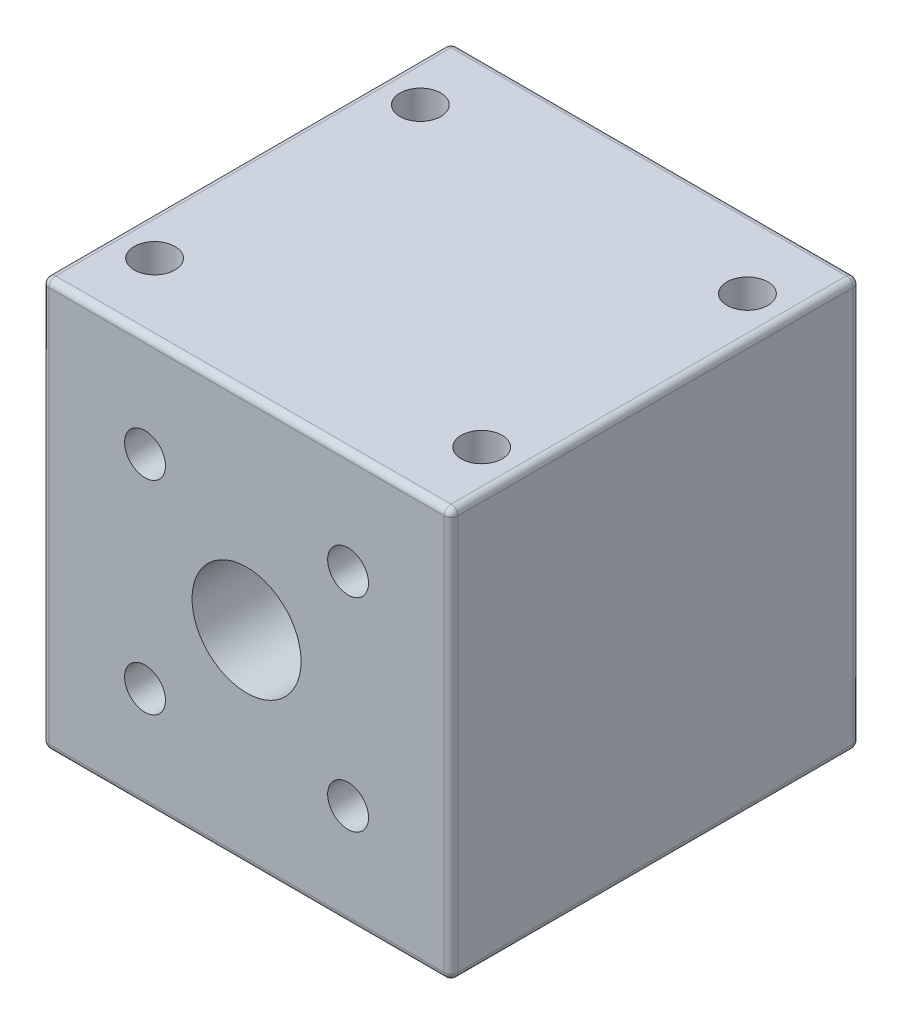
ISO-10303-21;
HEADER;
FILE_DESCRIPTION(('STEP AP214'),'2;1');
FILE_NAME('part.step','',(''),(''),'','','');
FILE_SCHEMA(('AUTOMOTIVE_DESIGN { 1 0 10303 214 1 1 1 1 }'));
ENDSEC;
DATA;
#1=APPLICATION_CONTEXT('core data for automotive mechanical design processes');
#2=APPLICATION_PROTOCOL_DEFINITION('international standard','automotive_design',2000,#1);
#3=PRODUCT_CONTEXT('',#1,'mechanical');
#4=PRODUCT('Part','Part','',(#3));
#5=PRODUCT_RELATED_PRODUCT_CATEGORY('part','',(#4));
#6=PRODUCT_DEFINITION_FORMATION('','',#4);
#7=PRODUCT_DEFINITION_CONTEXT('part definition',#1,'design');
#8=PRODUCT_DEFINITION('design','',#6,#7);
#9=PRODUCT_DEFINITION_SHAPE('','',#8);
#10=(LENGTH_UNIT() NAMED_UNIT(*) SI_UNIT(.MILLI.,.METRE.));
#11=(NAMED_UNIT(*) PLANE_ANGLE_UNIT() SI_UNIT($,.RADIAN.));
#12=(NAMED_UNIT(*) SI_UNIT($,.STERADIAN.) SOLID_ANGLE_UNIT());
#13=UNCERTAINTY_MEASURE_WITH_UNIT(LENGTH_MEASURE(1.E-05),#10,'distance_accuracy_value','');
#14=(GEOMETRIC_REPRESENTATION_CONTEXT(3) GLOBAL_UNCERTAINTY_ASSIGNED_CONTEXT((#13)) GLOBAL_UNIT_ASSIGNED_CONTEXT((#10,
#11,#12)) REPRESENTATION_CONTEXT('',''));
#15=CARTESIAN_POINT('',(0.,0.,0.));
#16=DIRECTION('',(0.,0.,1.));
#17=DIRECTION('',(1.,0.,0.));
#18=AXIS2_PLACEMENT_3D('',#15,#16,#17);
#19=CARTESIAN_POINT('',(14.5,-14.5,0.5));
#20=DIRECTION('',(0.,1.,0.));
#21=DIRECTION('',(0.,0.,1.));
#22=AXIS2_PLACEMENT_3D('',#19,#20,#21);
#23=CYLINDRICAL_SURFACE('',#22,0.5);
#24=CARTESIAN_POINT('',(14.5,-14.5,0.5));
#25=DIRECTION('',(0.,-1.,0.));
#26=DIRECTION('',(0.,0.,-1.));
#27=AXIS2_PLACEMENT_3D('',#24,#25,#26);
#28=CIRCLE('',#27,0.5);
#29=CARTESIAN_POINT('',(14.5,-14.5,0.));
#30=VERTEX_POINT('',#29);
#31=CARTESIAN_POINT('',(15.,-14.5,0.5));
#32=VERTEX_POINT('',#31);
#33=EDGE_CURVE('E11',#30,#32,#28,.T.);
#34=ORIENTED_EDGE('',*,*,#33,.F.);
#35=DIRECTION('',(0.,-1.,0.));
#36=VECTOR('',#35,1.);
#37=CARTESIAN_POINT('',(14.5,-14.5,0.));
#38=LINE('',#37,#36);
#39=CARTESIAN_POINT('',(14.5,14.5,0.));
#40=VERTEX_POINT('',#39);
#41=EDGE_CURVE('E203',#40,#30,#38,.T.);
#42=ORIENTED_EDGE('',*,*,#41,.F.);
#43=CARTESIAN_POINT('',(14.5,14.5,0.5));
#44=DIRECTION('',(0.,-1.,0.));
#45=DIRECTION('',(0.,0.,-1.));
#46=AXIS2_PLACEMENT_3D('',#43,#44,#45);
#47=CIRCLE('',#46,0.5);
#48=CARTESIAN_POINT('',(15.,14.5,0.5));
#49=VERTEX_POINT('',#48);
#50=EDGE_CURVE('E44',#40,#49,#47,.T.);
#51=ORIENTED_EDGE('',*,*,#50,.T.);
#52=DIRECTION('',(0.,-1.,0.));
#53=VECTOR('',#52,1.);
#54=CARTESIAN_POINT('',(15.,-14.5,0.5));
#55=LINE('',#54,#53);
#56=EDGE_CURVE('E232',#32,#49,#55,.F.);
#57=ORIENTED_EDGE('',*,*,#56,.F.);
#58=EDGE_LOOP('',(#34,#42,#51,#57));
#59=FACE_BOUND('',#58,.T.);
#60=ADVANCED_FACE('F37',(#59),#23,.T.);
#61=CARTESIAN_POINT('',(14.5,14.5,0.5));
#62=DIRECTION('',(0.,0.,-1.));
#63=DIRECTION('',(-1.,0.,0.));
#64=AXIS2_PLACEMENT_3D('',#61,#62,#63);
#65=SPHERICAL_SURFACE('',#64,0.5);
#66=ORIENTED_EDGE('',*,*,#50,.F.);
#67=CARTESIAN_POINT('',(14.5,14.5,0.5));
#68=DIRECTION('',(1.,0.,0.));
#69=DIRECTION('',(0.,0.,-1.));
#70=AXIS2_PLACEMENT_3D('',#67,#68,#69);
#71=CIRCLE('',#70,0.5);
#72=CARTESIAN_POINT('',(14.5,15.,0.5));
#73=VERTEX_POINT('',#72);
#74=EDGE_CURVE('E57',#40,#73,#71,.T.);
#75=ORIENTED_EDGE('',*,*,#74,.T.);
#76=CARTESIAN_POINT('',(14.5,14.5,0.5));
#77=DIRECTION('',(0.,0.,-1.));
#78=DIRECTION('',(-1.,0.,0.));
#79=AXIS2_PLACEMENT_3D('',#76,#77,#78);
#80=CIRCLE('',#79,0.5);
#81=EDGE_CURVE('E230',#49,#73,#80,.F.);
#82=ORIENTED_EDGE('',*,*,#81,.F.);
#83=EDGE_LOOP('',(#66,#75,#82));
#84=FACE_BOUND('',#83,.T.);
#85=ADVANCED_FACE('F297',(#84),#65,.T.);
#86=CARTESIAN_POINT('',(-14.5,14.5,0.5));
#87=DIRECTION('',(-1.,0.,0.));
#88=DIRECTION('',(0.,0.,1.));
#89=AXIS2_PLACEMENT_3D('',#86,#87,#88);
#90=CYLINDRICAL_SURFACE('',#89,0.5);
#91=ORIENTED_EDGE('',*,*,#74,.F.);
#92=DIRECTION('',(1.,0.,0.));
#93=VECTOR('',#92,1.);
#94=CARTESIAN_POINT('',(-14.5,14.5,0.));
#95=LINE('',#94,#93);
#96=CARTESIAN_POINT('',(-14.5,14.5,0.));
#97=VERTEX_POINT('',#96);
#98=EDGE_CURVE('E206',#97,#40,#95,.T.);
#99=ORIENTED_EDGE('',*,*,#98,.F.);
#100=CARTESIAN_POINT('',(-14.5,14.5,0.5));
#101=DIRECTION('',(1.,0.,0.));
#102=DIRECTION('',(0.,0.,-1.));
#103=AXIS2_PLACEMENT_3D('',#100,#101,#102);
#104=CIRCLE('',#103,0.5);
#105=CARTESIAN_POINT('',(-14.5,15.,0.5));
#106=VERTEX_POINT('',#105);
#107=EDGE_CURVE('E242',#97,#106,#104,.T.);
#108=ORIENTED_EDGE('',*,*,#107,.T.);
#109=DIRECTION('',(1.,0.,0.));
#110=VECTOR('',#109,1.);
#111=CARTESIAN_POINT('',(-14.5,15.,0.5));
#112=LINE('',#111,#110);
#113=EDGE_CURVE('E227',#73,#106,#112,.F.);
#114=ORIENTED_EDGE('',*,*,#113,.F.);
#115=EDGE_LOOP('',(#91,#99,#108,#114));
#116=FACE_BOUND('',#115,.T.);
#117=ADVANCED_FACE('F247',(#116),#90,.T.);
#118=CARTESIAN_POINT('',(-14.5,14.5,0.5));
#119=DIRECTION('',(0.,0.,-1.));
#120=DIRECTION('',(-1.,0.,0.));
#121=AXIS2_PLACEMENT_3D('',#118,#119,#120);
#122=SPHERICAL_SURFACE('',#121,0.5);
#123=ORIENTED_EDGE('',*,*,#107,.F.);
#124=CARTESIAN_POINT('',(-14.5,14.5,0.5));
#125=DIRECTION('',(0.,1.,0.));
#126=DIRECTION('',(0.,0.,1.));
#127=AXIS2_PLACEMENT_3D('',#124,#125,#126);
#128=CIRCLE('',#127,0.5);
#129=CARTESIAN_POINT('',(-15.,14.5,0.5));
#130=VERTEX_POINT('',#129);
#131=EDGE_CURVE('E240',#97,#130,#128,.T.);
#132=ORIENTED_EDGE('',*,*,#131,.T.);
#133=CARTESIAN_POINT('',(-14.5,14.5,0.5));
#134=DIRECTION('',(0.,0.,-1.));
#135=DIRECTION('',(-1.,0.,0.));
#136=AXIS2_PLACEMENT_3D('',#133,#134,#135);
#137=CIRCLE('',#136,0.5);
#138=EDGE_CURVE('E224',#106,#130,#137,.F.);
#139=ORIENTED_EDGE('',*,*,#138,.F.);
#140=EDGE_LOOP('',(#123,#132,#139));
#141=FACE_BOUND('',#140,.T.);
#142=ADVANCED_FACE('F259',(#141),#122,.T.);
#143=CARTESIAN_POINT('',(-14.5,-14.5,0.5));
#144=DIRECTION('',(0.,-1.,0.));
#145=DIRECTION('',(0.,0.,-1.));
#146=AXIS2_PLACEMENT_3D('',#143,#144,#145);
#147=CYLINDRICAL_SURFACE('',#146,0.5);
#148=ORIENTED_EDGE('',*,*,#131,.F.);
#149=DIRECTION('',(0.,1.,0.));
#150=VECTOR('',#149,1.);
#151=CARTESIAN_POINT('',(-14.5,-14.5,0.));
#152=LINE('',#151,#150);
#153=CARTESIAN_POINT('',(-14.5,-14.5,0.));
#154=VERTEX_POINT('',#153);
#155=EDGE_CURVE('E209',#154,#97,#152,.T.);
#156=ORIENTED_EDGE('',*,*,#155,.F.);
#157=CARTESIAN_POINT('',(-14.5,-14.5,0.5));
#158=DIRECTION('',(0.,1.,0.));
#159=DIRECTION('',(0.,0.,1.));
#160=AXIS2_PLACEMENT_3D('',#157,#158,#159);
#161=CIRCLE('',#160,0.5);
#162=CARTESIAN_POINT('',(-15.,-14.5,0.5));
#163=VERTEX_POINT('',#162);
#164=EDGE_CURVE('E238',#154,#163,#161,.T.);
#165=ORIENTED_EDGE('',*,*,#164,.T.);
#166=DIRECTION('',(0.,1.,0.));
#167=VECTOR('',#166,1.);
#168=CARTESIAN_POINT('',(-15.,-14.5,0.5));
#169=LINE('',#168,#167);
#170=EDGE_CURVE('E221',#130,#163,#169,.F.);
#171=ORIENTED_EDGE('',*,*,#170,.F.);
#172=EDGE_LOOP('',(#148,#156,#165,#171));
#173=FACE_BOUND('',#172,.T.);
#174=ADVANCED_FACE('F325',(#173),#147,.T.);
#175=CARTESIAN_POINT('',(-14.5,-14.5,0.5));
#176=DIRECTION('',(0.,0.,-1.));
#177=DIRECTION('',(-1.,0.,0.));
#178=AXIS2_PLACEMENT_3D('',#175,#176,#177);
#179=SPHERICAL_SURFACE('',#178,0.5);
#180=ORIENTED_EDGE('',*,*,#164,.F.);
#181=CARTESIAN_POINT('',(-14.5,-14.5,0.5));
#182=DIRECTION('',(-1.,0.,0.));
#183=DIRECTION('',(0.,0.,1.));
#184=AXIS2_PLACEMENT_3D('',#181,#182,#183);
#185=CIRCLE('',#184,0.5);
#186=CARTESIAN_POINT('',(-14.5,-15.,0.5));
#187=VERTEX_POINT('',#186);
#188=EDGE_CURVE('E236',#154,#187,#185,.T.);
#189=ORIENTED_EDGE('',*,*,#188,.T.);
#190=CARTESIAN_POINT('',(-14.5,-14.5,0.5));
#191=DIRECTION('',(0.,0.,-1.));
#192=DIRECTION('',(-1.,0.,0.));
#193=AXIS2_PLACEMENT_3D('',#190,#191,#192);
#194=CIRCLE('',#193,0.499999999999999);
#195=EDGE_CURVE('E218',#163,#187,#194,.F.);
#196=ORIENTED_EDGE('',*,*,#195,.F.);
#197=EDGE_LOOP('',(#180,#189,#196));
#198=FACE_BOUND('',#197,.T.);
#199=ADVANCED_FACE('F318',(#198),#179,.T.);
#200=CARTESIAN_POINT('',(-14.5,-14.5,0.5));
#201=DIRECTION('',(1.,0.,0.));
#202=DIRECTION('',(0.,0.,-1.));
#203=AXIS2_PLACEMENT_3D('',#200,#201,#202);
#204=CYLINDRICAL_SURFACE('',#203,0.5);
#205=ORIENTED_EDGE('',*,*,#188,.F.);
#206=DIRECTION('',(-1.,0.,0.));
#207=VECTOR('',#206,1.);
#208=CARTESIAN_POINT('',(-14.5,-14.5,0.));
#209=LINE('',#208,#207);
#210=EDGE_CURVE('E212',#30,#154,#209,.T.);
#211=ORIENTED_EDGE('',*,*,#210,.F.);
#212=CARTESIAN_POINT('',(14.5,-14.5,0.5));
#213=DIRECTION('',(-1.,0.,0.));
#214=DIRECTION('',(0.,0.,1.));
#215=AXIS2_PLACEMENT_3D('',#212,#213,#214);
#216=CIRCLE('',#215,0.5);
#217=CARTESIAN_POINT('',(14.5,-15.,0.5));
#218=VERTEX_POINT('',#217);
#219=EDGE_CURVE('E234',#30,#218,#216,.T.);
#220=ORIENTED_EDGE('',*,*,#219,.T.);
#221=DIRECTION('',(-1.,0.,0.));
#222=VECTOR('',#221,1.);
#223=CARTESIAN_POINT('',(-14.5,-15.,0.5));
#224=LINE('',#223,#222);
#225=EDGE_CURVE('E215',#187,#218,#224,.F.);
#226=ORIENTED_EDGE('',*,*,#225,.F.);
#227=EDGE_LOOP('',(#205,#211,#220,#226));
#228=FACE_BOUND('',#227,.T.);
#229=ADVANCED_FACE('F319',(#228),#204,.T.);
#230=CARTESIAN_POINT('',(14.5,-14.5,0.5));
#231=DIRECTION('',(0.,0.,-1.));
#232=DIRECTION('',(-1.,0.,0.));
#233=AXIS2_PLACEMENT_3D('',#230,#231,#232);
#234=SPHERICAL_SURFACE('',#233,0.5);
#235=ORIENTED_EDGE('',*,*,#219,.F.);
#236=ORIENTED_EDGE('',*,*,#33,.T.);
#237=CARTESIAN_POINT('',(14.5,-14.5,0.5));
#238=DIRECTION('',(0.,0.,-1.));
#239=DIRECTION('',(-1.,0.,0.));
#240=AXIS2_PLACEMENT_3D('',#237,#238,#239);
#241=CIRCLE('',#240,0.499999999999999);
#242=EDGE_CURVE('E200',#218,#32,#241,.F.);
#243=ORIENTED_EDGE('',*,*,#242,.F.);
#244=EDGE_LOOP('',(#235,#236,#243));
#245=FACE_BOUND('',#244,.T.);
#246=ADVANCED_FACE('F292',(#245),#234,.T.);
#247=CARTESIAN_POINT('',(14.5,14.5,29.5));
#248=DIRECTION('',(0.,0.,-1.));
#249=DIRECTION('',(-1.,0.,0.));
#250=AXIS2_PLACEMENT_3D('',#247,#248,#249);
#251=SPHERICAL_SURFACE('',#250,0.5);
#252=CARTESIAN_POINT('',(14.5,14.5,29.5));
#253=DIRECTION('',(-1.,0.,0.));
#254=DIRECTION('',(0.,0.,1.));
#255=AXIS2_PLACEMENT_3D('',#252,#253,#254);
#256=CIRCLE('',#255,0.5);
#257=CARTESIAN_POINT('',(14.5,14.5,30.));
#258=VERTEX_POINT('',#257);
#259=CARTESIAN_POINT('',(14.5,15.,29.5));
#260=VERTEX_POINT('',#259);
#261=EDGE_CURVE('E198',#258,#260,#256,.T.);
#262=ORIENTED_EDGE('',*,*,#261,.F.);
#263=CARTESIAN_POINT('',(14.5,14.5,29.5));
#264=DIRECTION('',(0.,1.,0.));
#265=DIRECTION('',(0.,0.,1.));
#266=AXIS2_PLACEMENT_3D('',#263,#264,#265);
#267=CIRCLE('',#266,0.5);
#268=CARTESIAN_POINT('',(15.,14.5,29.5));
#269=VERTEX_POINT('',#268);
#270=EDGE_CURVE('E135',#258,#269,#267,.T.);
#271=ORIENTED_EDGE('',*,*,#270,.T.);
#272=CARTESIAN_POINT('',(14.5,14.5,29.5));
#273=DIRECTION('',(0.,0.,-1.));
#274=DIRECTION('',(-1.,0.,0.));
#275=AXIS2_PLACEMENT_3D('',#272,#273,#274);
#276=CIRCLE('',#275,0.5);
#277=EDGE_CURVE('E187',#260,#269,#276,.T.);
#278=ORIENTED_EDGE('',*,*,#277,.F.);
#279=EDGE_LOOP('',(#262,#271,#278));
#280=FACE_BOUND('',#279,.T.);
#281=ADVANCED_FACE('F302',(#280),#251,.T.);
#282=CARTESIAN_POINT('',(14.5,-14.5,29.5));
#283=DIRECTION('',(0.,1.,0.));
#284=DIRECTION('',(0.,0.,1.));
#285=AXIS2_PLACEMENT_3D('',#282,#283,#284);
#286=CYLINDRICAL_SURFACE('',#285,0.5);
#287=ORIENTED_EDGE('',*,*,#270,.F.);
#288=DIRECTION('',(0.,1.,0.));
#289=VECTOR('',#288,1.);
#290=CARTESIAN_POINT('',(14.5,-14.5,30.));
#291=LINE('',#290,#289);
#292=CARTESIAN_POINT('',(14.5,-14.5,30.));
#293=VERTEX_POINT('',#292);
#294=EDGE_CURVE('E154',#293,#258,#291,.T.);
#295=ORIENTED_EDGE('',*,*,#294,.F.);
#296=CARTESIAN_POINT('',(14.5,-14.5,29.5));
#297=DIRECTION('',(0.,1.,0.));
#298=DIRECTION('',(0.,0.,1.));
#299=AXIS2_PLACEMENT_3D('',#296,#297,#298);
#300=CIRCLE('',#299,0.5);
#301=CARTESIAN_POINT('',(15.,-14.5,29.5));
#302=VERTEX_POINT('',#301);
#303=EDGE_CURVE('E124',#293,#302,#300,.T.);
#304=ORIENTED_EDGE('',*,*,#303,.T.);
#305=DIRECTION('',(0.,1.,0.));
#306=VECTOR('',#305,1.);
#307=CARTESIAN_POINT('',(15.,-14.5,29.5));
#308=LINE('',#307,#306);
#309=EDGE_CURVE('E185',#269,#302,#308,.F.);
#310=ORIENTED_EDGE('',*,*,#309,.F.);
#311=EDGE_LOOP('',(#287,#295,#304,#310));
#312=FACE_BOUND('',#311,.T.);
#313=ADVANCED_FACE('F159',(#312),#286,.T.);
#314=CARTESIAN_POINT('',(14.5,-14.5,29.5));
#315=DIRECTION('',(0.,0.,-1.));
#316=DIRECTION('',(-1.,0.,0.));
#317=AXIS2_PLACEMENT_3D('',#314,#315,#316);
#318=SPHERICAL_SURFACE('',#317,0.5);
#319=ORIENTED_EDGE('',*,*,#303,.F.);
#320=CARTESIAN_POINT('',(14.5,-14.5,29.5));
#321=DIRECTION('',(1.,0.,0.));
#322=DIRECTION('',(0.,0.,-1.));
#323=AXIS2_PLACEMENT_3D('',#320,#321,#322);
#324=CIRCLE('',#323,0.5);
#325=CARTESIAN_POINT('',(14.5,-15.,29.5));
#326=VERTEX_POINT('',#325);
#327=EDGE_CURVE('E127',#293,#326,#324,.T.);
#328=ORIENTED_EDGE('',*,*,#327,.T.);
#329=CARTESIAN_POINT('',(14.5,-14.5,29.5));
#330=DIRECTION('',(0.,0.,-1.));
#331=DIRECTION('',(-1.,0.,0.));
#332=AXIS2_PLACEMENT_3D('',#329,#330,#331);
#333=CIRCLE('',#332,0.499999999999999);
#334=EDGE_CURVE('E129',#302,#326,#333,.T.);
#335=ORIENTED_EDGE('',*,*,#334,.F.);
#336=EDGE_LOOP('',(#319,#328,#335));
#337=FACE_BOUND('',#336,.T.);
#338=ADVANCED_FACE('F126',(#337),#318,.T.);
#339=CARTESIAN_POINT('',(-14.5,-14.5,29.5));
#340=DIRECTION('',(1.,0.,0.));
#341=DIRECTION('',(0.,0.,-1.));
#342=AXIS2_PLACEMENT_3D('',#339,#340,#341);
#343=CYLINDRICAL_SURFACE('',#342,0.5);
#344=ORIENTED_EDGE('',*,*,#327,.F.);
#345=DIRECTION('',(1.,0.,0.));
#346=VECTOR('',#345,1.);
#347=CARTESIAN_POINT('',(-14.5,-14.5,30.));
#348=LINE('',#347,#346);
#349=CARTESIAN_POINT('',(-14.5,-14.5,30.));
#350=VERTEX_POINT('',#349);
#351=EDGE_CURVE('E142',#350,#293,#348,.T.);
#352=ORIENTED_EDGE('',*,*,#351,.F.);
#353=CARTESIAN_POINT('',(-14.5,-14.5,29.5));
#354=DIRECTION('',(1.,0.,0.));
#355=DIRECTION('',(0.,0.,-1.));
#356=AXIS2_PLACEMENT_3D('',#353,#354,#355);
#357=CIRCLE('',#356,0.5);
#358=CARTESIAN_POINT('',(-14.5,-15.,29.5));
#359=VERTEX_POINT('',#358);
#360=EDGE_CURVE('E146',#350,#359,#357,.T.);
#361=ORIENTED_EDGE('',*,*,#360,.T.);
#362=DIRECTION('',(1.,0.,0.));
#363=VECTOR('',#362,1.);
#364=CARTESIAN_POINT('',(-14.5,-15.,29.5));
#365=LINE('',#364,#363);
#366=EDGE_CURVE('E144',#326,#359,#365,.F.);
#367=ORIENTED_EDGE('',*,*,#366,.F.);
#368=EDGE_LOOP('',(#344,#352,#361,#367));
#369=FACE_BOUND('',#368,.T.);
#370=ADVANCED_FACE('F141',(#369),#343,.T.);
#371=CARTESIAN_POINT('',(-14.5,-14.5,29.5));
#372=DIRECTION('',(0.,0.,-1.));
#373=DIRECTION('',(-1.,0.,0.));
#374=AXIS2_PLACEMENT_3D('',#371,#372,#373);
#375=SPHERICAL_SURFACE('',#374,0.5);
#376=ORIENTED_EDGE('',*,*,#360,.F.);
#377=CARTESIAN_POINT('',(-14.5,-14.5,29.5));
#378=DIRECTION('',(0.,-1.,0.));
#379=DIRECTION('',(0.,0.,-1.));
#380=AXIS2_PLACEMENT_3D('',#377,#378,#379);
#381=CIRCLE('',#380,0.5);
#382=CARTESIAN_POINT('',(-15.,-14.5,29.5));
#383=VERTEX_POINT('',#382);
#384=EDGE_CURVE('E194',#350,#383,#381,.T.);
#385=ORIENTED_EDGE('',*,*,#384,.T.);
#386=CARTESIAN_POINT('',(-14.5,-14.5,29.5));
#387=DIRECTION('',(0.,0.,-1.));
#388=DIRECTION('',(-1.,0.,0.));
#389=AXIS2_PLACEMENT_3D('',#386,#387,#388);
#390=CIRCLE('',#389,0.499999999999999);
#391=EDGE_CURVE('E180',#359,#383,#390,.T.);
#392=ORIENTED_EDGE('',*,*,#391,.F.);
#393=EDGE_LOOP('',(#376,#385,#392));
#394=FACE_BOUND('',#393,.T.);
#395=ADVANCED_FACE('F312',(#394),#375,.T.);
#396=CARTESIAN_POINT('',(-14.5,-14.5,29.5));
#397=DIRECTION('',(0.,-1.,0.));
#398=DIRECTION('',(0.,0.,-1.));
#399=AXIS2_PLACEMENT_3D('',#396,#397,#398);
#400=CYLINDRICAL_SURFACE('',#399,0.5);
#401=ORIENTED_EDGE('',*,*,#384,.F.);
#402=DIRECTION('',(0.,-1.,0.));
#403=VECTOR('',#402,1.);
#404=CARTESIAN_POINT('',(-14.5,-14.5,30.));
#405=LINE('',#404,#403);
#406=CARTESIAN_POINT('',(-14.5,14.5,30.));
#407=VERTEX_POINT('',#406);
#408=EDGE_CURVE('E156',#407,#350,#405,.T.);
#409=ORIENTED_EDGE('',*,*,#408,.F.);
#410=CARTESIAN_POINT('',(-14.5,14.5,29.5));
#411=DIRECTION('',(0.,-1.,0.));
#412=DIRECTION('',(0.,0.,-1.));
#413=AXIS2_PLACEMENT_3D('',#410,#411,#412);
#414=CIRCLE('',#413,0.5);
#415=CARTESIAN_POINT('',(-15.,14.5,29.5));
#416=VERTEX_POINT('',#415);
#417=EDGE_CURVE('E192',#407,#416,#414,.T.);
#418=ORIENTED_EDGE('',*,*,#417,.T.);
#419=DIRECTION('',(0.,-1.,0.));
#420=VECTOR('',#419,1.);
#421=CARTESIAN_POINT('',(-15.,-14.5,29.5));
#422=LINE('',#421,#420);
#423=EDGE_CURVE('E177',#383,#416,#422,.F.);
#424=ORIENTED_EDGE('',*,*,#423,.F.);
#425=EDGE_LOOP('',(#401,#409,#418,#424));
#426=FACE_BOUND('',#425,.T.);
#427=ADVANCED_FACE('F308',(#426),#400,.T.);
#428=CARTESIAN_POINT('',(-14.5,14.5,29.5));
#429=DIRECTION('',(0.,0.,-1.));
#430=DIRECTION('',(-1.,0.,0.));
#431=AXIS2_PLACEMENT_3D('',#428,#429,#430);
#432=SPHERICAL_SURFACE('',#431,0.5);
#433=ORIENTED_EDGE('',*,*,#417,.F.);
#434=CARTESIAN_POINT('',(-14.5,14.5,29.5));
#435=DIRECTION('',(-1.,0.,0.));
#436=DIRECTION('',(0.,0.,1.));
#437=AXIS2_PLACEMENT_3D('',#434,#435,#436);
#438=CIRCLE('',#437,0.5);
#439=CARTESIAN_POINT('',(-14.5,15.,29.5));
#440=VERTEX_POINT('',#439);
#441=EDGE_CURVE('E190',#407,#440,#438,.T.);
#442=ORIENTED_EDGE('',*,*,#441,.T.);
#443=CARTESIAN_POINT('',(-14.5,14.5,29.5));
#444=DIRECTION('',(0.,0.,-1.));
#445=DIRECTION('',(-1.,0.,0.));
#446=AXIS2_PLACEMENT_3D('',#443,#444,#445);
#447=CIRCLE('',#446,0.5);
#448=EDGE_CURVE('E174',#416,#440,#447,.T.);
#449=ORIENTED_EDGE('',*,*,#448,.F.);
#450=EDGE_LOOP('',(#433,#442,#449));
#451=FACE_BOUND('',#450,.T.);
#452=ADVANCED_FACE('F329',(#451),#432,.T.);
#453=CARTESIAN_POINT('',(-14.5,14.5,29.5));
#454=DIRECTION('',(-1.,0.,0.));
#455=DIRECTION('',(0.,0.,1.));
#456=AXIS2_PLACEMENT_3D('',#453,#454,#455);
#457=CYLINDRICAL_SURFACE('',#456,0.5);
#458=DIRECTION('',(-1.,0.,0.));
#459=VECTOR('',#458,1.);
#460=CARTESIAN_POINT('',(-14.5,14.5,30.));
#461=LINE('',#460,#459);
#462=EDGE_CURVE('E169',#258,#407,#461,.T.);
#463=ORIENTED_EDGE('',*,*,#462,.F.);
#464=ORIENTED_EDGE('',*,*,#261,.T.);
#465=DIRECTION('',(-1.,0.,0.));
#466=VECTOR('',#465,1.);
#467=CARTESIAN_POINT('',(-14.5,15.,29.5));
#468=LINE('',#467,#466);
#469=EDGE_CURVE('E171',#440,#260,#468,.F.);
#470=ORIENTED_EDGE('',*,*,#469,.F.);
#471=ORIENTED_EDGE('',*,*,#441,.F.);
#472=EDGE_LOOP('',(#463,#464,#470,#471));
#473=FACE_BOUND('',#472,.T.);
#474=ADVANCED_FACE('F305',(#473),#457,.T.);
#475=CARTESIAN_POINT('',(-14.5,-14.5,30.));
#476=DIRECTION('',(0.,0.,-1.));
#477=DIRECTION('',(-1.,0.,0.));
#478=AXIS2_PLACEMENT_3D('',#475,#476,#477);
#479=PLANE('',#478);
#480=ORIENTED_EDGE('',*,*,#294,.T.);
#481=ORIENTED_EDGE('',*,*,#462,.T.);
#482=ORIENTED_EDGE('',*,*,#408,.T.);
#483=ORIENTED_EDGE('',*,*,#351,.T.);
#484=EDGE_LOOP('',(#480,#481,#482,#483));
#485=FACE_BOUND('',#484,.T.);
#486=CARTESIAN_POINT('',(0.,0.,30.));
#487=DIRECTION('',(0.,0.,1.));
#488=DIRECTION('',(1.,0.,0.));
#489=AXIS2_PLACEMENT_3D('',#486,#487,#488);
#490=CIRCLE('',#489,4.);
#491=CARTESIAN_POINT('',(4.,0.,30.));
#492=VERTEX_POINT('',#491);
#493=EDGE_CURVE('E672',#492,#492,#490,.T.);
#494=ORIENTED_EDGE('',*,*,#493,.F.);
#495=EDGE_LOOP('',(#494));
#496=FACE_BOUND('',#495,.T.);
#497=CARTESIAN_POINT('',(-7.45,7.45,30.));
#498=DIRECTION('',(0.,0.,1.));
#499=DIRECTION('',(1.,0.,0.));
#500=AXIS2_PLACEMENT_3D('',#497,#498,#499);
#501=CIRCLE('',#500,1.5);
#502=CARTESIAN_POINT('',(-5.95,7.45,30.));
#503=VERTEX_POINT('',#502);
#504=EDGE_CURVE('E666',#503,#503,#501,.T.);
#505=ORIENTED_EDGE('',*,*,#504,.F.);
#506=EDGE_LOOP('',(#505));
#507=FACE_BOUND('',#506,.T.);
#508=CARTESIAN_POINT('',(7.45,7.45,30.));
#509=DIRECTION('',(0.,0.,1.));
#510=DIRECTION('',(1.,0.,0.));
#511=AXIS2_PLACEMENT_3D('',#508,#509,#510);
#512=CIRCLE('',#511,1.5);
#513=CARTESIAN_POINT('',(8.95,7.45,30.));
#514=VERTEX_POINT('',#513);
#515=EDGE_CURVE('E660',#514,#514,#512,.T.);
#516=ORIENTED_EDGE('',*,*,#515,.F.);
#517=EDGE_LOOP('',(#516));
#518=FACE_BOUND('',#517,.T.);
#519=CARTESIAN_POINT('',(-7.45,-7.45,30.));
#520=DIRECTION('',(0.,0.,1.));
#521=DIRECTION('',(1.,0.,0.));
#522=AXIS2_PLACEMENT_3D('',#519,#520,#521);
#523=CIRCLE('',#522,1.5);
#524=CARTESIAN_POINT('',(-5.95,-7.45,30.));
#525=VERTEX_POINT('',#524);
#526=EDGE_CURVE('E654',#525,#525,#523,.T.);
#527=ORIENTED_EDGE('',*,*,#526,.F.);
#528=EDGE_LOOP('',(#527));
#529=FACE_BOUND('',#528,.T.);
#530=CARTESIAN_POINT('',(7.45,-7.45,30.));
#531=DIRECTION('',(0.,0.,1.));
#532=DIRECTION('',(1.,0.,0.));
#533=AXIS2_PLACEMENT_3D('',#530,#531,#532);
#534=CIRCLE('',#533,1.5);
#535=CARTESIAN_POINT('',(8.95,-7.45,30.));
#536=VERTEX_POINT('',#535);
#537=EDGE_CURVE('E648',#536,#536,#534,.T.);
#538=ORIENTED_EDGE('',*,*,#537,.F.);
#539=EDGE_LOOP('',(#538));
#540=FACE_BOUND('',#539,.T.);
#541=ADVANCED_FACE('F151',(#485,#496,#507,#518,#529,#540),#479,.F.);
#542=CARTESIAN_POINT('',(-14.5,-14.5,0.));
#543=DIRECTION('',(0.,0.,-1.));
#544=DIRECTION('',(-1.,0.,0.));
#545=AXIS2_PLACEMENT_3D('',#542,#543,#544);
#546=PLANE('',#545);
#547=ORIENTED_EDGE('',*,*,#41,.T.);
#548=ORIENTED_EDGE('',*,*,#210,.T.);
#549=ORIENTED_EDGE('',*,*,#155,.T.);
#550=ORIENTED_EDGE('',*,*,#98,.T.);
#551=EDGE_LOOP('',(#547,#548,#549,#550));
#552=FACE_BOUND('',#551,.T.);
#553=CARTESIAN_POINT('',(-7.45,-7.45,0.));
#554=DIRECTION('',(0.,0.,1.));
#555=DIRECTION('',(1.,0.,0.));
#556=AXIS2_PLACEMENT_3D('',#553,#554,#555);
#557=CIRCLE('',#556,1.5);
#558=CARTESIAN_POINT('',(-5.95,-7.45,0.));
#559=VERTEX_POINT('',#558);
#560=EDGE_CURVE('E651',#559,#559,#557,.T.);
#561=ORIENTED_EDGE('',*,*,#560,.T.);
#562=EDGE_LOOP('',(#561));
#563=FACE_BOUND('',#562,.T.);
#564=CARTESIAN_POINT('',(-7.45,7.45,0.));
#565=DIRECTION('',(0.,0.,1.));
#566=DIRECTION('',(1.,0.,0.));
#567=AXIS2_PLACEMENT_3D('',#564,#565,#566);
#568=CIRCLE('',#567,1.5);
#569=CARTESIAN_POINT('',(-5.95,7.45,0.));
#570=VERTEX_POINT('',#569);
#571=EDGE_CURVE('E663',#570,#570,#568,.T.);
#572=ORIENTED_EDGE('',*,*,#571,.T.);
#573=EDGE_LOOP('',(#572));
#574=FACE_BOUND('',#573,.T.);
#575=CARTESIAN_POINT('',(0.,0.,0.));
#576=DIRECTION('',(0.,0.,1.));
#577=DIRECTION('',(1.,0.,0.));
#578=AXIS2_PLACEMENT_3D('',#575,#576,#577);
#579=CIRCLE('',#578,4.);
#580=CARTESIAN_POINT('',(4.,0.,0.));
#581=VERTEX_POINT('',#580);
#582=EDGE_CURVE('E669',#581,#581,#579,.T.);
#583=ORIENTED_EDGE('',*,*,#582,.T.);
#584=EDGE_LOOP('',(#583));
#585=FACE_BOUND('',#584,.T.);
#586=CARTESIAN_POINT('',(7.45,7.45,0.));
#587=DIRECTION('',(0.,0.,1.));
#588=DIRECTION('',(1.,0.,0.));
#589=AXIS2_PLACEMENT_3D('',#586,#587,#588);
#590=CIRCLE('',#589,1.5);
#591=CARTESIAN_POINT('',(8.95,7.45,0.));
#592=VERTEX_POINT('',#591);
#593=EDGE_CURVE('E657',#592,#592,#590,.T.);
#594=ORIENTED_EDGE('',*,*,#593,.T.);
#595=EDGE_LOOP('',(#594));
#596=FACE_BOUND('',#595,.T.);
#597=CARTESIAN_POINT('',(7.45,-7.45,0.));
#598=DIRECTION('',(0.,0.,1.));
#599=DIRECTION('',(1.,0.,0.));
#600=AXIS2_PLACEMENT_3D('',#597,#598,#599);
#601=CIRCLE('',#600,1.5);
#602=CARTESIAN_POINT('',(8.95,-7.45,0.));
#603=VERTEX_POINT('',#602);
#604=EDGE_CURVE('E643',#603,#603,#601,.T.);
#605=ORIENTED_EDGE('',*,*,#604,.T.);
#606=EDGE_LOOP('',(#605));
#607=FACE_BOUND('',#606,.T.);
#608=ADVANCED_FACE('F322',(#552,#563,#574,#585,#596,#607),#546,.T.);
#609=CARTESIAN_POINT('',(-14.5,-14.5,30.));
#610=DIRECTION('',(0.,0.,-1.));
#611=DIRECTION('',(-1.,0.,0.));
#612=AXIS2_PLACEMENT_3D('',#609,#610,#611);
#613=CYLINDRICAL_SURFACE('',#612,0.499999999999999);
#614=DIRECTION('',(0.,0.,-1.));
#615=VECTOR('',#614,1.);
#616=CARTESIAN_POINT('',(-15.,-14.5,30.));
#617=LINE('',#616,#615);
#618=EDGE_CURVE('E271',#383,#163,#617,.T.);
#619=ORIENTED_EDGE('',*,*,#618,.T.);
#620=ORIENTED_EDGE('',*,*,#195,.T.);
#621=DIRECTION('',(0.,0.,-1.));
#622=VECTOR('',#621,1.);
#623=CARTESIAN_POINT('',(-14.5,-15.,30.));
#624=LINE('',#623,#622);
#625=EDGE_CURVE('E161',#359,#187,#624,.T.);
#626=ORIENTED_EDGE('',*,*,#625,.F.);
#627=ORIENTED_EDGE('',*,*,#391,.T.);
#628=EDGE_LOOP('',(#619,#620,#626,#627));
#629=FACE_BOUND('',#628,.T.);
#630=ADVANCED_FACE('F315',(#629),#613,.T.);
#631=CARTESIAN_POINT('',(-14.5,-15.,30.));
#632=DIRECTION('',(0.,1.,0.));
#633=DIRECTION('',(0.,0.,1.));
#634=AXIS2_PLACEMENT_3D('',#631,#632,#633);
#635=PLANE('',#634);
#636=CARTESIAN_POINT('',(-12.,-15.,5.25));
#637=DIRECTION('',(0.,-1.,0.));
#638=DIRECTION('',(0.,0.,-1.));
#639=AXIS2_PLACEMENT_3D('',#636,#637,#638);
#640=CIRCLE('',#639,1.5);
#641=CARTESIAN_POINT('',(-12.,-15.,3.75));
#642=VERTEX_POINT('',#641);
#643=EDGE_CURVE('E634',#642,#642,#640,.T.);
#644=ORIENTED_EDGE('',*,*,#643,.F.);
#645=EDGE_LOOP('',(#644));
#646=FACE_BOUND('',#645,.T.);
#647=CARTESIAN_POINT('',(12.,-15.,5.25));
#648=DIRECTION('',(0.,-1.,0.));
#649=DIRECTION('',(0.,0.,-1.));
#650=AXIS2_PLACEMENT_3D('',#647,#648,#649);
#651=CIRCLE('',#650,1.5);
#652=CARTESIAN_POINT('',(12.,-15.,3.75));
#653=VERTEX_POINT('',#652);
#654=EDGE_CURVE('E636',#653,#653,#651,.T.);
#655=ORIENTED_EDGE('',*,*,#654,.F.);
#656=EDGE_LOOP('',(#655));
#657=FACE_BOUND('',#656,.T.);
#658=CARTESIAN_POINT('',(12.,-15.,24.75));
#659=DIRECTION('',(0.,-1.,0.));
#660=DIRECTION('',(0.,0.,-1.));
#661=AXIS2_PLACEMENT_3D('',#658,#659,#660);
#662=CIRCLE('',#661,1.5);
#663=CARTESIAN_POINT('',(12.,-15.,23.25));
#664=VERTEX_POINT('',#663);
#665=EDGE_CURVE('E702',#664,#664,#662,.T.);
#666=ORIENTED_EDGE('',*,*,#665,.F.);
#667=EDGE_LOOP('',(#666));
#668=FACE_BOUND('',#667,.T.);
#669=CARTESIAN_POINT('',(-12.,-15.,24.75));
#670=DIRECTION('',(0.,-1.,0.));
#671=DIRECTION('',(0.,0.,-1.));
#672=AXIS2_PLACEMENT_3D('',#669,#670,#671);
#673=CIRCLE('',#672,1.5);
#674=CARTESIAN_POINT('',(-12.,-15.,23.25));
#675=VERTEX_POINT('',#674);
#676=EDGE_CURVE('E644',#675,#675,#673,.T.);
#677=ORIENTED_EDGE('',*,*,#676,.F.);
#678=EDGE_LOOP('',(#677));
#679=FACE_BOUND('',#678,.T.);
#680=ORIENTED_EDGE('',*,*,#625,.T.);
#681=ORIENTED_EDGE('',*,*,#225,.T.);
#682=DIRECTION('',(0.,0.,-1.));
#683=VECTOR('',#682,1.);
#684=CARTESIAN_POINT('',(14.5,-15.,30.));
#685=LINE('',#684,#683);
#686=EDGE_CURVE('E164',#326,#218,#685,.T.);
#687=ORIENTED_EDGE('',*,*,#686,.F.);
#688=ORIENTED_EDGE('',*,*,#366,.T.);
#689=EDGE_LOOP('',(#680,#681,#687,#688));
#690=FACE_BOUND('',#689,.T.);
#691=ADVANCED_FACE('F284',(#646,#657,#668,#679,#690),#635,.F.);
#692=CARTESIAN_POINT('',(14.5,-14.5,30.));
#693=DIRECTION('',(0.,0.,-1.));
#694=DIRECTION('',(-1.,0.,0.));
#695=AXIS2_PLACEMENT_3D('',#692,#693,#694);
#696=CYLINDRICAL_SURFACE('',#695,0.499999999999999);
#697=ORIENTED_EDGE('',*,*,#686,.T.);
#698=ORIENTED_EDGE('',*,*,#242,.T.);
#699=DIRECTION('',(0.,0.,-1.));
#700=VECTOR('',#699,1.);
#701=CARTESIAN_POINT('',(15.,-14.5,30.));
#702=LINE('',#701,#700);
#703=EDGE_CURVE('E277',#302,#32,#702,.T.);
#704=ORIENTED_EDGE('',*,*,#703,.F.);
#705=ORIENTED_EDGE('',*,*,#334,.T.);
#706=EDGE_LOOP('',(#697,#698,#704,#705));
#707=FACE_BOUND('',#706,.T.);
#708=ADVANCED_FACE('F281',(#707),#696,.T.);
#709=CARTESIAN_POINT('',(15.,-14.5,30.));
#710=DIRECTION('',(-1.,0.,0.));
#711=DIRECTION('',(0.,0.,1.));
#712=AXIS2_PLACEMENT_3D('',#709,#710,#711);
#713=PLANE('',#712);
#714=ORIENTED_EDGE('',*,*,#703,.T.);
#715=ORIENTED_EDGE('',*,*,#56,.T.);
#716=DIRECTION('',(0.,0.,-1.));
#717=VECTOR('',#716,1.);
#718=CARTESIAN_POINT('',(15.,14.5,30.));
#719=LINE('',#718,#717);
#720=EDGE_CURVE('E268',#269,#49,#719,.T.);
#721=ORIENTED_EDGE('',*,*,#720,.F.);
#722=ORIENTED_EDGE('',*,*,#309,.T.);
#723=EDGE_LOOP('',(#714,#715,#721,#722));
#724=FACE_BOUND('',#723,.T.);
#725=ADVANCED_FACE('F296',(#724),#713,.F.);
#726=CARTESIAN_POINT('',(14.5,14.5,30.));
#727=DIRECTION('',(0.,0.,-1.));
#728=DIRECTION('',(-1.,0.,0.));
#729=AXIS2_PLACEMENT_3D('',#726,#727,#728);
#730=CYLINDRICAL_SURFACE('',#729,0.5);
#731=ORIENTED_EDGE('',*,*,#720,.T.);
#732=ORIENTED_EDGE('',*,*,#81,.T.);
#733=DIRECTION('',(0.,0.,-1.));
#734=VECTOR('',#733,1.);
#735=CARTESIAN_POINT('',(14.5,15.,30.));
#736=LINE('',#735,#734);
#737=EDGE_CURVE('E258',#260,#73,#736,.T.);
#738=ORIENTED_EDGE('',*,*,#737,.F.);
#739=ORIENTED_EDGE('',*,*,#277,.T.);
#740=EDGE_LOOP('',(#731,#732,#738,#739));
#741=FACE_BOUND('',#740,.T.);
#742=ADVANCED_FACE('F299',(#741),#730,.T.);
#743=CARTESIAN_POINT('',(-14.5,15.,30.));
#744=DIRECTION('',(0.,-1.,0.));
#745=DIRECTION('',(0.,0.,-1.));
#746=AXIS2_PLACEMENT_3D('',#743,#744,#745);
#747=PLANE('',#746);
#748=CARTESIAN_POINT('',(-12.,15.,5.25));
#749=DIRECTION('',(0.,-1.,0.));
#750=DIRECTION('',(0.,0.,-1.));
#751=AXIS2_PLACEMENT_3D('',#748,#749,#750);
#752=CIRCLE('',#751,1.5);
#753=CARTESIAN_POINT('',(-12.,15.,3.75));
#754=VERTEX_POINT('',#753);
#755=EDGE_CURVE('E631',#754,#754,#752,.T.);
#756=ORIENTED_EDGE('',*,*,#755,.T.);
#757=EDGE_LOOP('',(#756));
#758=FACE_BOUND('',#757,.T.);
#759=CARTESIAN_POINT('',(12.,15.,5.25));
#760=DIRECTION('',(0.,-1.,0.));
#761=DIRECTION('',(0.,0.,-1.));
#762=AXIS2_PLACEMENT_3D('',#759,#760,#761);
#763=CIRCLE('',#762,1.5);
#764=CARTESIAN_POINT('',(12.,15.,3.75));
#765=VERTEX_POINT('',#764);
#766=EDGE_CURVE('E707',#765,#765,#763,.T.);
#767=ORIENTED_EDGE('',*,*,#766,.T.);
#768=EDGE_LOOP('',(#767));
#769=FACE_BOUND('',#768,.T.);
#770=CARTESIAN_POINT('',(12.,15.,24.75));
#771=DIRECTION('',(0.,-1.,0.));
#772=DIRECTION('',(0.,0.,-1.));
#773=AXIS2_PLACEMENT_3D('',#770,#771,#772);
#774=CIRCLE('',#773,1.5);
#775=CARTESIAN_POINT('',(12.,15.,23.25));
#776=VERTEX_POINT('',#775);
#777=EDGE_CURVE('E647',#776,#776,#774,.T.);
#778=ORIENTED_EDGE('',*,*,#777,.T.);
#779=EDGE_LOOP('',(#778));
#780=FACE_BOUND('',#779,.T.);
#781=CARTESIAN_POINT('',(-12.,15.,24.75));
#782=DIRECTION('',(0.,-1.,0.));
#783=DIRECTION('',(0.,0.,-1.));
#784=AXIS2_PLACEMENT_3D('',#781,#782,#783);
#785=CIRCLE('',#784,1.5);
#786=CARTESIAN_POINT('',(-12.,15.,23.25));
#787=VERTEX_POINT('',#786);
#788=EDGE_CURVE('E640',#787,#787,#785,.T.);
#789=ORIENTED_EDGE('',*,*,#788,.T.);
#790=EDGE_LOOP('',(#789));
#791=FACE_BOUND('',#790,.T.);
#792=ORIENTED_EDGE('',*,*,#737,.T.);
#793=ORIENTED_EDGE('',*,*,#113,.T.);
#794=DIRECTION('',(0.,0.,-1.));
#795=VECTOR('',#794,1.);
#796=CARTESIAN_POINT('',(-14.5,15.,30.));
#797=LINE('',#796,#795);
#798=EDGE_CURVE('E256',#440,#106,#797,.T.);
#799=ORIENTED_EDGE('',*,*,#798,.F.);
#800=ORIENTED_EDGE('',*,*,#469,.T.);
#801=EDGE_LOOP('',(#792,#793,#799,#800));
#802=FACE_BOUND('',#801,.T.);
#803=ADVANCED_FACE('F254',(#758,#769,#780,#791,#802),#747,.F.);
#804=CARTESIAN_POINT('',(-14.5,14.5,30.));
#805=DIRECTION('',(0.,0.,-1.));
#806=DIRECTION('',(-1.,0.,0.));
#807=AXIS2_PLACEMENT_3D('',#804,#805,#806);
#808=CYLINDRICAL_SURFACE('',#807,0.5);
#809=ORIENTED_EDGE('',*,*,#798,.T.);
#810=ORIENTED_EDGE('',*,*,#138,.T.);
#811=DIRECTION('',(0.,0.,-1.));
#812=VECTOR('',#811,1.);
#813=CARTESIAN_POINT('',(-15.,14.5,30.));
#814=LINE('',#813,#812);
#815=EDGE_CURVE('E266',#416,#130,#814,.T.);
#816=ORIENTED_EDGE('',*,*,#815,.F.);
#817=ORIENTED_EDGE('',*,*,#448,.T.);
#818=EDGE_LOOP('',(#809,#810,#816,#817));
#819=FACE_BOUND('',#818,.T.);
#820=ADVANCED_FACE('F263',(#819),#808,.T.);
#821=CARTESIAN_POINT('',(-15.,-14.5,30.));
#822=DIRECTION('',(1.,0.,0.));
#823=DIRECTION('',(0.,0.,-1.));
#824=AXIS2_PLACEMENT_3D('',#821,#822,#823);
#825=PLANE('',#824);
#826=ORIENTED_EDGE('',*,*,#815,.T.);
#827=ORIENTED_EDGE('',*,*,#170,.T.);
#828=ORIENTED_EDGE('',*,*,#618,.F.);
#829=ORIENTED_EDGE('',*,*,#423,.T.);
#830=EDGE_LOOP('',(#826,#827,#828,#829));
#831=FACE_BOUND('',#830,.T.);
#832=ADVANCED_FACE('F327',(#831),#825,.F.);
#833=CARTESIAN_POINT('',(0.,0.,30.));
#834=DIRECTION('',(0.,0.,-1.));
#835=DIRECTION('',(-1.,0.,0.));
#836=AXIS2_PLACEMENT_3D('',#833,#834,#835);
#837=CYLINDRICAL_SURFACE('',#836,4.);
#838=ORIENTED_EDGE('',*,*,#493,.T.);
#839=EDGE_LOOP('',(#838));
#840=FACE_BOUND('',#839,.T.);
#841=ORIENTED_EDGE('',*,*,#582,.F.);
#842=EDGE_LOOP('',(#841));
#843=FACE_BOUND('',#842,.T.);
#844=ADVANCED_FACE('F510',(#840,#843),#837,.F.);
#845=CARTESIAN_POINT('',(-7.45,7.45,30.));
#846=DIRECTION('',(0.,0.,-1.));
#847=DIRECTION('',(-1.,0.,0.));
#848=AXIS2_PLACEMENT_3D('',#845,#846,#847);
#849=CYLINDRICAL_SURFACE('',#848,1.5);
#850=ORIENTED_EDGE('',*,*,#504,.T.);
#851=EDGE_LOOP('',(#850));
#852=FACE_BOUND('',#851,.T.);
#853=ORIENTED_EDGE('',*,*,#571,.F.);
#854=EDGE_LOOP('',(#853));
#855=FACE_BOUND('',#854,.T.);
#856=ADVANCED_FACE('F520',(#852,#855),#849,.F.);
#857=CARTESIAN_POINT('',(7.45,7.45,30.));
#858=DIRECTION('',(0.,0.,-1.));
#859=DIRECTION('',(-1.,0.,0.));
#860=AXIS2_PLACEMENT_3D('',#857,#858,#859);
#861=CYLINDRICAL_SURFACE('',#860,1.5);
#862=ORIENTED_EDGE('',*,*,#515,.T.);
#863=EDGE_LOOP('',(#862));
#864=FACE_BOUND('',#863,.T.);
#865=ORIENTED_EDGE('',*,*,#593,.F.);
#866=EDGE_LOOP('',(#865));
#867=FACE_BOUND('',#866,.T.);
#868=ADVANCED_FACE('F527',(#864,#867),#861,.F.);
#869=CARTESIAN_POINT('',(-7.45,-7.45,30.));
#870=DIRECTION('',(0.,0.,-1.));
#871=DIRECTION('',(-1.,0.,0.));
#872=AXIS2_PLACEMENT_3D('',#869,#870,#871);
#873=CYLINDRICAL_SURFACE('',#872,1.5);
#874=ORIENTED_EDGE('',*,*,#526,.T.);
#875=EDGE_LOOP('',(#874));
#876=FACE_BOUND('',#875,.T.);
#877=ORIENTED_EDGE('',*,*,#560,.F.);
#878=EDGE_LOOP('',(#877));
#879=FACE_BOUND('',#878,.T.);
#880=ADVANCED_FACE('F535',(#876,#879),#873,.F.);
#881=CARTESIAN_POINT('',(7.45,-7.45,30.));
#882=DIRECTION('',(0.,0.,-1.));
#883=DIRECTION('',(-1.,0.,0.));
#884=AXIS2_PLACEMENT_3D('',#881,#882,#883);
#885=CYLINDRICAL_SURFACE('',#884,1.5);
#886=ORIENTED_EDGE('',*,*,#537,.T.);
#887=EDGE_LOOP('',(#886));
#888=FACE_BOUND('',#887,.T.);
#889=ORIENTED_EDGE('',*,*,#604,.F.);
#890=EDGE_LOOP('',(#889));
#891=FACE_BOUND('',#890,.T.);
#892=ADVANCED_FACE('F543',(#888,#891),#885,.F.);
#893=CARTESIAN_POINT('',(-12.,15.,24.75));
#894=DIRECTION('',(0.,-1.,0.));
#895=DIRECTION('',(0.,0.,-1.));
#896=AXIS2_PLACEMENT_3D('',#893,#894,#895);
#897=CYLINDRICAL_SURFACE('',#896,1.5);
#898=ORIENTED_EDGE('',*,*,#788,.F.);
#899=EDGE_LOOP('',(#898));
#900=FACE_BOUND('',#899,.T.);
#901=ORIENTED_EDGE('',*,*,#676,.T.);
#902=EDGE_LOOP('',(#901));
#903=FACE_BOUND('',#902,.T.);
#904=ADVANCED_FACE('F551',(#900,#903),#897,.F.);
#905=CARTESIAN_POINT('',(12.,15.,24.75));
#906=DIRECTION('',(0.,-1.,0.));
#907=DIRECTION('',(0.,0.,-1.));
#908=AXIS2_PLACEMENT_3D('',#905,#906,#907);
#909=CYLINDRICAL_SURFACE('',#908,1.5);
#910=ORIENTED_EDGE('',*,*,#777,.F.);
#911=EDGE_LOOP('',(#910));
#912=FACE_BOUND('',#911,.T.);
#913=ORIENTED_EDGE('',*,*,#665,.T.);
#914=EDGE_LOOP('',(#913));
#915=FACE_BOUND('',#914,.T.);
#916=ADVANCED_FACE('F559',(#912,#915),#909,.F.);
#917=CARTESIAN_POINT('',(12.,15.,5.25));
#918=DIRECTION('',(0.,-1.,0.));
#919=DIRECTION('',(0.,0.,-1.));
#920=AXIS2_PLACEMENT_3D('',#917,#918,#919);
#921=CYLINDRICAL_SURFACE('',#920,1.5);
#922=ORIENTED_EDGE('',*,*,#766,.F.);
#923=EDGE_LOOP('',(#922));
#924=FACE_BOUND('',#923,.T.);
#925=ORIENTED_EDGE('',*,*,#654,.T.);
#926=EDGE_LOOP('',(#925));
#927=FACE_BOUND('',#926,.T.);
#928=ADVANCED_FACE('F567',(#924,#927),#921,.F.);
#929=CARTESIAN_POINT('',(-12.,15.,5.25));
#930=DIRECTION('',(0.,-1.,0.));
#931=DIRECTION('',(0.,0.,-1.));
#932=AXIS2_PLACEMENT_3D('',#929,#930,#931);
#933=CYLINDRICAL_SURFACE('',#932,1.5);
#934=ORIENTED_EDGE('',*,*,#755,.F.);
#935=EDGE_LOOP('',(#934));
#936=FACE_BOUND('',#935,.T.);
#937=ORIENTED_EDGE('',*,*,#643,.T.);
#938=EDGE_LOOP('',(#937));
#939=FACE_BOUND('',#938,.T.);
#940=ADVANCED_FACE('F575',(#936,#939),#933,.F.);
#941=CLOSED_SHELL('',(#60,#85,#117,#142,#174,#199,#229,#246,#281,#313,#338,#370,#395,#427,#452,
#474,#541,#608,#630,#691,#708,#725,#742,#803,#820,#832,#844,#856,#868,#880,#892,#904,#916,#928,#940));
#942=MANIFOLD_SOLID_BREP('B2',#941);
#943=ADVANCED_BREP_SHAPE_REPRESENTATION('',(#18,#942),#14);
#944=SHAPE_DEFINITION_REPRESENTATION(#9,#943);
ENDSEC;
END-ISO-10303-21;
